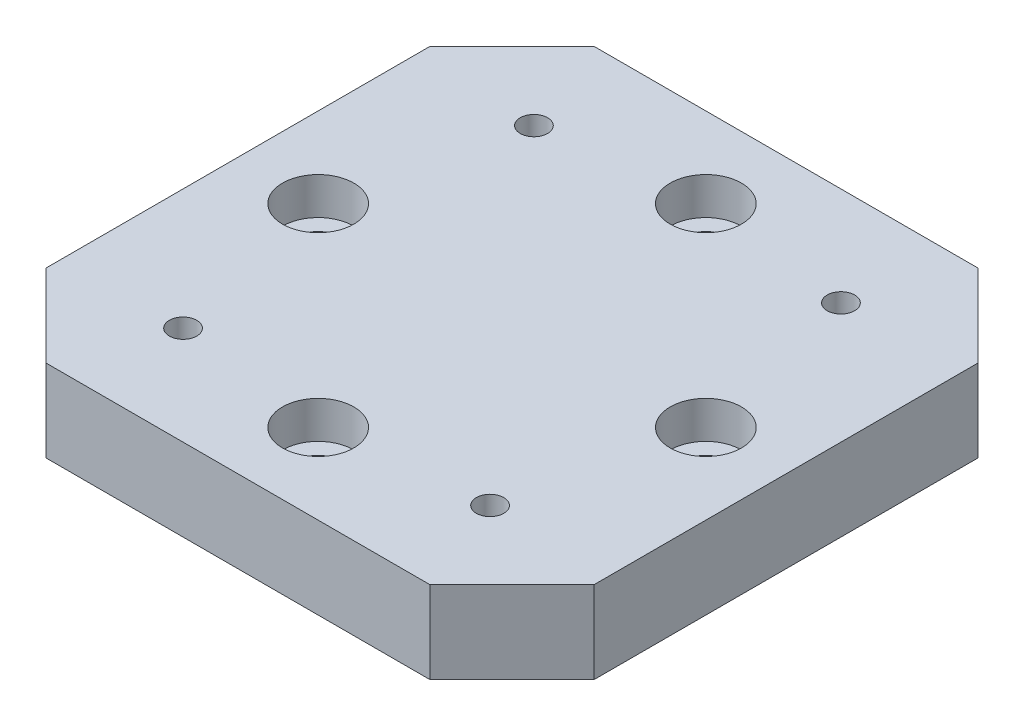
ISO-10303-21;
HEADER;
FILE_DESCRIPTION(('STEP AP214'),'2;1');
FILE_NAME('part.step','',(''),(''),'','','');
FILE_SCHEMA(('AUTOMOTIVE_DESIGN { 1 0 10303 214 1 1 1 1 }'));
ENDSEC;
DATA;
#1=APPLICATION_CONTEXT('core data for automotive mechanical design processes');
#2=APPLICATION_PROTOCOL_DEFINITION('international standard','automotive_design',2000,#1);
#3=PRODUCT_CONTEXT('',#1,'mechanical');
#4=PRODUCT('Part','Part','',(#3));
#5=PRODUCT_RELATED_PRODUCT_CATEGORY('part','',(#4));
#6=PRODUCT_DEFINITION_FORMATION('','',#4);
#7=PRODUCT_DEFINITION_CONTEXT('part definition',#1,'design');
#8=PRODUCT_DEFINITION('design','',#6,#7);
#9=PRODUCT_DEFINITION_SHAPE('','',#8);
#10=(LENGTH_UNIT() NAMED_UNIT(*) SI_UNIT(.MILLI.,.METRE.));
#11=(NAMED_UNIT(*) PLANE_ANGLE_UNIT() SI_UNIT($,.RADIAN.));
#12=(NAMED_UNIT(*) SI_UNIT($,.STERADIAN.) SOLID_ANGLE_UNIT());
#13=UNCERTAINTY_MEASURE_WITH_UNIT(LENGTH_MEASURE(1.E-05),#10,'distance_accuracy_value','');
#14=(GEOMETRIC_REPRESENTATION_CONTEXT(3) GLOBAL_UNCERTAINTY_ASSIGNED_CONTEXT((#13)) GLOBAL_UNIT_ASSIGNED_CONTEXT((#10,
#11,#12)) REPRESENTATION_CONTEXT('',''));
#15=CARTESIAN_POINT('',(0.,0.,0.));
#16=DIRECTION('',(0.,0.,1.));
#17=DIRECTION('',(1.,0.,0.));
#18=AXIS2_PLACEMENT_3D('',#15,#16,#17);
#19=CARTESIAN_POINT('',(0.,7.5,0.));
#20=DIRECTION('',(0.,-1.,0.));
#21=DIRECTION('',(0.,0.,-1.));
#22=AXIS2_PLACEMENT_3D('',#19,#20,#21);
#23=PLANE('',#22);
#24=CARTESIAN_POINT('',(0.,7.5,-17.6776695296637));
#25=DIRECTION('',(0.,1.,0.));
#26=DIRECTION('',(0.,0.,1.));
#27=AXIS2_PLACEMENT_3D('',#24,#25,#26);
#28=CIRCLE('',#27,3.25);
#29=CARTESIAN_POINT('',(0.,7.5,-14.4276695296637));
#30=VERTEX_POINT('',#29);
#31=EDGE_CURVE('E254',#30,#30,#28,.T.);
#32=ORIENTED_EDGE('',*,*,#31,.F.);
#33=EDGE_LOOP('',(#32));
#34=FACE_BOUND('',#33,.T.);
#35=CARTESIAN_POINT('',(-17.6776695296637,7.5,0.));
#36=DIRECTION('',(0.,1.,0.));
#37=DIRECTION('',(0.,0.,1.));
#38=AXIS2_PLACEMENT_3D('',#35,#36,#37);
#39=CIRCLE('',#38,3.25);
#40=CARTESIAN_POINT('',(-17.6776695296637,7.5,3.25));
#41=VERTEX_POINT('',#40);
#42=EDGE_CURVE('E242',#41,#41,#39,.T.);
#43=ORIENTED_EDGE('',*,*,#42,.F.);
#44=EDGE_LOOP('',(#43));
#45=FACE_BOUND('',#44,.T.);
#46=CARTESIAN_POINT('',(17.6776695296637,7.5,0.));
#47=DIRECTION('',(0.,1.,0.));
#48=DIRECTION('',(0.,0.,1.));
#49=AXIS2_PLACEMENT_3D('',#46,#47,#48);
#50=CIRCLE('',#49,3.25);
#51=CARTESIAN_POINT('',(17.6776695296637,7.5,3.24999999999999));
#52=VERTEX_POINT('',#51);
#53=EDGE_CURVE('E230',#52,#52,#50,.T.);
#54=ORIENTED_EDGE('',*,*,#53,.F.);
#55=EDGE_LOOP('',(#54));
#56=FACE_BOUND('',#55,.T.);
#57=CARTESIAN_POINT('',(0.,7.5,17.6776695296637));
#58=DIRECTION('',(0.,1.,0.));
#59=DIRECTION('',(0.,0.,1.));
#60=AXIS2_PLACEMENT_3D('',#57,#58,#59);
#61=CIRCLE('',#60,3.25);
#62=CARTESIAN_POINT('',(0.,7.5,20.9276695296637));
#63=VERTEX_POINT('',#62);
#64=EDGE_CURVE('E218',#63,#63,#61,.T.);
#65=ORIENTED_EDGE('',*,*,#64,.F.);
#66=EDGE_LOOP('',(#65));
#67=FACE_BOUND('',#66,.T.);
#68=CARTESIAN_POINT('',(-14.,7.5,-16.));
#69=DIRECTION('',(0.,1.,0.));
#70=DIRECTION('',(0.,0.,1.));
#71=AXIS2_PLACEMENT_3D('',#68,#69,#70);
#72=CIRCLE('',#71,1.24999999999999);
#73=CARTESIAN_POINT('',(-14.,7.5,-14.75));
#74=VERTEX_POINT('',#73);
#75=EDGE_CURVE('E200',#74,#74,#72,.T.);
#76=ORIENTED_EDGE('',*,*,#75,.F.);
#77=EDGE_LOOP('',(#76));
#78=FACE_BOUND('',#77,.T.);
#79=CARTESIAN_POINT('',(14.,7.5,16.));
#80=DIRECTION('',(0.,1.,0.));
#81=DIRECTION('',(0.,0.,1.));
#82=AXIS2_PLACEMENT_3D('',#79,#80,#81);
#83=CIRCLE('',#82,1.24999999999999);
#84=CARTESIAN_POINT('',(14.,7.5,17.25));
#85=VERTEX_POINT('',#84);
#86=EDGE_CURVE('E139',#85,#85,#83,.T.);
#87=ORIENTED_EDGE('',*,*,#86,.F.);
#88=EDGE_LOOP('',(#87));
#89=FACE_BOUND('',#88,.T.);
#90=DIRECTION('',(1.,0.,0.));
#91=VECTOR('',#90,1.);
#92=CARTESIAN_POINT('',(-25.,7.5,25.));
#93=LINE('',#92,#91);
#94=CARTESIAN_POINT('',(-17.5,7.5,25.));
#95=VERTEX_POINT('',#94);
#96=CARTESIAN_POINT('',(17.5,7.5,25.));
#97=VERTEX_POINT('',#96);
#98=EDGE_CURVE('E142',#95,#97,#93,.T.);
#99=ORIENTED_EDGE('',*,*,#98,.T.);
#100=DIRECTION('',(-0.707106781186549,0.,0.707106781186546));
#101=VECTOR('',#100,1.);
#102=CARTESIAN_POINT('',(25.,7.5,17.5));
#103=LINE('',#102,#101);
#104=CARTESIAN_POINT('',(25.,7.5,17.5));
#105=VERTEX_POINT('',#104);
#106=EDGE_CURVE('E160',#97,#105,#103,.F.);
#107=ORIENTED_EDGE('',*,*,#106,.T.);
#108=DIRECTION('',(0.,0.,-1.));
#109=VECTOR('',#108,1.);
#110=CARTESIAN_POINT('',(25.,7.5,25.));
#111=LINE('',#110,#109);
#112=CARTESIAN_POINT('',(25.,7.5,-17.5));
#113=VERTEX_POINT('',#112);
#114=EDGE_CURVE('E125',#105,#113,#111,.T.);
#115=ORIENTED_EDGE('',*,*,#114,.T.);
#116=DIRECTION('',(0.707106781186546,0.,0.70710678118655));
#117=VECTOR('',#116,1.);
#118=CARTESIAN_POINT('',(17.5,7.5,-25.));
#119=LINE('',#118,#117);
#120=CARTESIAN_POINT('',(17.5,7.5,-25.));
#121=VERTEX_POINT('',#120);
#122=EDGE_CURVE('E156',#113,#121,#119,.F.);
#123=ORIENTED_EDGE('',*,*,#122,.T.);
#124=DIRECTION('',(-1.,0.,0.));
#125=VECTOR('',#124,1.);
#126=CARTESIAN_POINT('',(-25.,7.5,-25.));
#127=LINE('',#126,#125);
#128=CARTESIAN_POINT('',(-17.5,7.5,-25.));
#129=VERTEX_POINT('',#128);
#130=EDGE_CURVE('E169',#121,#129,#127,.T.);
#131=ORIENTED_EDGE('',*,*,#130,.T.);
#132=DIRECTION('',(0.707106781186549,0.,-0.707106781186546));
#133=VECTOR('',#132,1.);
#134=CARTESIAN_POINT('',(-25.,7.5,-17.5));
#135=LINE('',#134,#133);
#136=CARTESIAN_POINT('',(-25.,7.5,-17.5));
#137=VERTEX_POINT('',#136);
#138=EDGE_CURVE('E60',#129,#137,#135,.F.);
#139=ORIENTED_EDGE('',*,*,#138,.T.);
#140=DIRECTION('',(0.,0.,1.));
#141=VECTOR('',#140,1.);
#142=CARTESIAN_POINT('',(-25.,7.5,25.));
#143=LINE('',#142,#141);
#144=CARTESIAN_POINT('',(-25.,7.5,17.5));
#145=VERTEX_POINT('',#144);
#146=EDGE_CURVE('E175',#137,#145,#143,.T.);
#147=ORIENTED_EDGE('',*,*,#146,.T.);
#148=DIRECTION('',(-0.707106781186546,0.,-0.707106781186549));
#149=VECTOR('',#148,1.);
#150=CARTESIAN_POINT('',(-17.5,7.5,25.));
#151=LINE('',#150,#149);
#152=EDGE_CURVE('E158',#145,#95,#151,.F.);
#153=ORIENTED_EDGE('',*,*,#152,.T.);
#154=EDGE_LOOP('',(#99,#107,#115,#123,#131,#139,#147,#153));
#155=FACE_BOUND('',#154,.T.);
#156=CARTESIAN_POINT('',(14.,7.5,-16.));
#157=DIRECTION('',(0.,1.,0.));
#158=DIRECTION('',(0.,0.,1.));
#159=AXIS2_PLACEMENT_3D('',#156,#157,#158);
#160=CIRCLE('',#159,1.24999999999999);
#161=CARTESIAN_POINT('',(14.,7.5,-14.75));
#162=VERTEX_POINT('',#161);
#163=EDGE_CURVE('E194',#162,#162,#160,.T.);
#164=ORIENTED_EDGE('',*,*,#163,.F.);
#165=EDGE_LOOP('',(#164));
#166=FACE_BOUND('',#165,.T.);
#167=CARTESIAN_POINT('',(-14.,7.5,16.));
#168=DIRECTION('',(0.,1.,0.));
#169=DIRECTION('',(0.,0.,1.));
#170=AXIS2_PLACEMENT_3D('',#167,#168,#169);
#171=CIRCLE('',#170,1.24999999999999);
#172=CARTESIAN_POINT('',(-14.,7.5,17.25));
#173=VERTEX_POINT('',#172);
#174=EDGE_CURVE('E206',#173,#173,#171,.T.);
#175=ORIENTED_EDGE('',*,*,#174,.F.);
#176=EDGE_LOOP('',(#175));
#177=FACE_BOUND('',#176,.T.);
#178=ADVANCED_FACE('F38',(#34,#45,#56,#67,#78,#89,#155,#166,#177),#23,.F.);
#179=CARTESIAN_POINT('',(25.,7.5,25.));
#180=DIRECTION('',(-1.,0.,0.));
#181=DIRECTION('',(0.,0.,1.));
#182=AXIS2_PLACEMENT_3D('',#179,#180,#181);
#183=PLANE('',#182);
#184=ORIENTED_EDGE('',*,*,#114,.F.);
#185=DIRECTION('',(0.,-1.,0.));
#186=VECTOR('',#185,1.);
#187=CARTESIAN_POINT('',(25.,7.5,17.5));
#188=LINE('',#187,#186);
#189=CARTESIAN_POINT('',(25.,0.,17.5));
#190=VERTEX_POINT('',#189);
#191=EDGE_CURVE('E109',#105,#190,#188,.T.);
#192=ORIENTED_EDGE('',*,*,#191,.T.);
#193=DIRECTION('',(0.,0.,-1.));
#194=VECTOR('',#193,1.);
#195=CARTESIAN_POINT('',(25.,0.,25.));
#196=LINE('',#195,#194);
#197=CARTESIAN_POINT('',(25.,0.,-17.5));
#198=VERTEX_POINT('',#197);
#199=EDGE_CURVE('E122',#190,#198,#196,.T.);
#200=ORIENTED_EDGE('',*,*,#199,.T.);
#201=DIRECTION('',(0.,1.,0.));
#202=VECTOR('',#201,1.);
#203=CARTESIAN_POINT('',(25.,7.5,-17.5));
#204=LINE('',#203,#202);
#205=EDGE_CURVE('E127',#198,#113,#204,.T.);
#206=ORIENTED_EDGE('',*,*,#205,.T.);
#207=EDGE_LOOP('',(#184,#192,#200,#206));
#208=FACE_BOUND('',#207,.T.);
#209=ADVANCED_FACE('F121',(#208),#183,.F.);
#210=CARTESIAN_POINT('',(-25.,7.5,-25.));
#211=DIRECTION('',(0.,0.,1.));
#212=DIRECTION('',(1.,0.,0.));
#213=AXIS2_PLACEMENT_3D('',#210,#211,#212);
#214=PLANE('',#213);
#215=ORIENTED_EDGE('',*,*,#130,.F.);
#216=DIRECTION('',(0.,-1.,0.));
#217=VECTOR('',#216,1.);
#218=CARTESIAN_POINT('',(17.5,7.5,-25.));
#219=LINE('',#218,#217);
#220=CARTESIAN_POINT('',(17.5,0.,-25.));
#221=VERTEX_POINT('',#220);
#222=EDGE_CURVE('E11',#121,#221,#219,.T.);
#223=ORIENTED_EDGE('',*,*,#222,.T.);
#224=DIRECTION('',(-1.,0.,0.));
#225=VECTOR('',#224,1.);
#226=CARTESIAN_POINT('',(-25.,0.,-25.));
#227=LINE('',#226,#225);
#228=CARTESIAN_POINT('',(-17.5,0.,-25.));
#229=VERTEX_POINT('',#228);
#230=EDGE_CURVE('E132',#221,#229,#227,.T.);
#231=ORIENTED_EDGE('',*,*,#230,.T.);
#232=DIRECTION('',(0.,1.,0.));
#233=VECTOR('',#232,1.);
#234=CARTESIAN_POINT('',(-17.5,7.5,-25.));
#235=LINE('',#234,#233);
#236=EDGE_CURVE('E46',#229,#129,#235,.T.);
#237=ORIENTED_EDGE('',*,*,#236,.T.);
#238=EDGE_LOOP('',(#215,#223,#231,#237));
#239=FACE_BOUND('',#238,.T.);
#240=ADVANCED_FACE('F168',(#239),#214,.F.);
#241=CARTESIAN_POINT('',(-25.,7.5,25.));
#242=DIRECTION('',(1.,0.,0.));
#243=DIRECTION('',(0.,0.,-1.));
#244=AXIS2_PLACEMENT_3D('',#241,#242,#243);
#245=PLANE('',#244);
#246=DIRECTION('',(0.,0.,1.));
#247=VECTOR('',#246,1.);
#248=CARTESIAN_POINT('',(-25.,0.,25.));
#249=LINE('',#248,#247);
#250=CARTESIAN_POINT('',(-25.,0.,-17.5));
#251=VERTEX_POINT('',#250);
#252=CARTESIAN_POINT('',(-25.,0.,17.5));
#253=VERTEX_POINT('',#252);
#254=EDGE_CURVE('E136',#251,#253,#249,.T.);
#255=ORIENTED_EDGE('',*,*,#254,.T.);
#256=DIRECTION('',(0.,1.,0.));
#257=VECTOR('',#256,1.);
#258=CARTESIAN_POINT('',(-25.,7.5,17.5));
#259=LINE('',#258,#257);
#260=EDGE_CURVE('E53',#253,#145,#259,.T.);
#261=ORIENTED_EDGE('',*,*,#260,.T.);
#262=ORIENTED_EDGE('',*,*,#146,.F.);
#263=DIRECTION('',(0.,-1.,0.));
#264=VECTOR('',#263,1.);
#265=CARTESIAN_POINT('',(-25.,7.5,-17.5));
#266=LINE('',#265,#264);
#267=EDGE_CURVE('E162',#137,#251,#266,.T.);
#268=ORIENTED_EDGE('',*,*,#267,.T.);
#269=EDGE_LOOP('',(#255,#261,#262,#268));
#270=FACE_BOUND('',#269,.T.);
#271=ADVANCED_FACE('F179',(#270),#245,.F.);
#272=CARTESIAN_POINT('',(-25.,7.5,25.));
#273=DIRECTION('',(0.,0.,-1.));
#274=DIRECTION('',(-1.,0.,0.));
#275=AXIS2_PLACEMENT_3D('',#272,#273,#274);
#276=PLANE('',#275);
#277=DIRECTION('',(1.,0.,0.));
#278=VECTOR('',#277,1.);
#279=CARTESIAN_POINT('',(-25.,0.,25.));
#280=LINE('',#279,#278);
#281=CARTESIAN_POINT('',(-17.5,0.,25.));
#282=VERTEX_POINT('',#281);
#283=CARTESIAN_POINT('',(17.5,0.,25.));
#284=VERTEX_POINT('',#283);
#285=EDGE_CURVE('E146',#282,#284,#280,.T.);
#286=ORIENTED_EDGE('',*,*,#285,.T.);
#287=DIRECTION('',(0.,1.,0.));
#288=VECTOR('',#287,1.);
#289=CARTESIAN_POINT('',(17.5,7.5,25.));
#290=LINE('',#289,#288);
#291=EDGE_CURVE('E110',#284,#97,#290,.T.);
#292=ORIENTED_EDGE('',*,*,#291,.T.);
#293=ORIENTED_EDGE('',*,*,#98,.F.);
#294=DIRECTION('',(0.,-1.,0.));
#295=VECTOR('',#294,1.);
#296=CARTESIAN_POINT('',(-17.5,7.5,25.));
#297=LINE('',#296,#295);
#298=EDGE_CURVE('E115',#95,#282,#297,.T.);
#299=ORIENTED_EDGE('',*,*,#298,.T.);
#300=EDGE_LOOP('',(#286,#292,#293,#299));
#301=FACE_BOUND('',#300,.T.);
#302=ADVANCED_FACE('F186',(#301),#276,.F.);
#303=CARTESIAN_POINT('',(0.,0.,0.));
#304=DIRECTION('',(0.,-1.,0.));
#305=DIRECTION('',(0.,0.,-1.));
#306=AXIS2_PLACEMENT_3D('',#303,#304,#305);
#307=PLANE('',#306);
#308=CARTESIAN_POINT('',(0.,0.,-17.6776695296637));
#309=DIRECTION('',(0.,-1.,0.));
#310=DIRECTION('',(0.,0.,-1.));
#311=AXIS2_PLACEMENT_3D('',#308,#309,#310);
#312=CIRCLE('',#311,1.7);
#313=CARTESIAN_POINT('',(0.,0.,-19.3776695296637));
#314=VERTEX_POINT('',#313);
#315=EDGE_CURVE('E245',#314,#314,#312,.T.);
#316=ORIENTED_EDGE('',*,*,#315,.F.);
#317=EDGE_LOOP('',(#316));
#318=FACE_BOUND('',#317,.T.);
#319=CARTESIAN_POINT('',(-17.6776695296637,0.,0.));
#320=DIRECTION('',(0.,-1.,0.));
#321=DIRECTION('',(0.,0.,-1.));
#322=AXIS2_PLACEMENT_3D('',#319,#320,#321);
#323=CIRCLE('',#322,1.7);
#324=CARTESIAN_POINT('',(-17.6776695296637,0.,-1.7));
#325=VERTEX_POINT('',#324);
#326=EDGE_CURVE('E233',#325,#325,#323,.T.);
#327=ORIENTED_EDGE('',*,*,#326,.F.);
#328=EDGE_LOOP('',(#327));
#329=FACE_BOUND('',#328,.T.);
#330=CARTESIAN_POINT('',(17.6776695296637,0.,0.));
#331=DIRECTION('',(0.,-1.,0.));
#332=DIRECTION('',(0.,0.,-1.));
#333=AXIS2_PLACEMENT_3D('',#330,#331,#332);
#334=CIRCLE('',#333,1.7);
#335=CARTESIAN_POINT('',(17.6776695296637,0.,-1.7));
#336=VERTEX_POINT('',#335);
#337=EDGE_CURVE('E221',#336,#336,#334,.T.);
#338=ORIENTED_EDGE('',*,*,#337,.F.);
#339=EDGE_LOOP('',(#338));
#340=FACE_BOUND('',#339,.T.);
#341=CARTESIAN_POINT('',(0.,0.,17.6776695296637));
#342=DIRECTION('',(0.,-1.,0.));
#343=DIRECTION('',(0.,0.,-1.));
#344=AXIS2_PLACEMENT_3D('',#341,#342,#343);
#345=CIRCLE('',#344,1.7);
#346=CARTESIAN_POINT('',(0.,0.,15.9776695296637));
#347=VERTEX_POINT('',#346);
#348=EDGE_CURVE('E209',#347,#347,#345,.T.);
#349=ORIENTED_EDGE('',*,*,#348,.F.);
#350=EDGE_LOOP('',(#349));
#351=FACE_BOUND('',#350,.T.);
#352=CARTESIAN_POINT('',(-14.,0.,16.));
#353=DIRECTION('',(0.,-1.,0.));
#354=DIRECTION('',(0.,0.,-1.));
#355=AXIS2_PLACEMENT_3D('',#352,#353,#354);
#356=CIRCLE('',#355,1.24999999999999);
#357=CARTESIAN_POINT('',(-14.,0.,14.75));
#358=VERTEX_POINT('',#357);
#359=EDGE_CURVE('E203',#358,#358,#356,.T.);
#360=ORIENTED_EDGE('',*,*,#359,.F.);
#361=EDGE_LOOP('',(#360));
#362=FACE_BOUND('',#361,.T.);
#363=CARTESIAN_POINT('',(-14.,0.,-16.));
#364=DIRECTION('',(0.,-1.,0.));
#365=DIRECTION('',(0.,0.,-1.));
#366=AXIS2_PLACEMENT_3D('',#363,#364,#365);
#367=CIRCLE('',#366,1.24999999999999);
#368=CARTESIAN_POINT('',(-14.,0.,-17.25));
#369=VERTEX_POINT('',#368);
#370=EDGE_CURVE('E197',#369,#369,#367,.T.);
#371=ORIENTED_EDGE('',*,*,#370,.F.);
#372=EDGE_LOOP('',(#371));
#373=FACE_BOUND('',#372,.T.);
#374=CARTESIAN_POINT('',(14.,0.,-16.));
#375=DIRECTION('',(0.,-1.,0.));
#376=DIRECTION('',(0.,0.,-1.));
#377=AXIS2_PLACEMENT_3D('',#374,#375,#376);
#378=CIRCLE('',#377,1.24999999999999);
#379=CARTESIAN_POINT('',(14.,0.,-17.25));
#380=VERTEX_POINT('',#379);
#381=EDGE_CURVE('E191',#380,#380,#378,.T.);
#382=ORIENTED_EDGE('',*,*,#381,.F.);
#383=EDGE_LOOP('',(#382));
#384=FACE_BOUND('',#383,.T.);
#385=CARTESIAN_POINT('',(14.,0.,16.));
#386=DIRECTION('',(0.,-1.,0.));
#387=DIRECTION('',(0.,0.,-1.));
#388=AXIS2_PLACEMENT_3D('',#385,#386,#387);
#389=CIRCLE('',#388,1.24999999999999);
#390=CARTESIAN_POINT('',(14.,0.,14.75));
#391=VERTEX_POINT('',#390);
#392=EDGE_CURVE('E133',#391,#391,#389,.T.);
#393=ORIENTED_EDGE('',*,*,#392,.F.);
#394=EDGE_LOOP('',(#393));
#395=FACE_BOUND('',#394,.T.);
#396=ORIENTED_EDGE('',*,*,#199,.F.);
#397=DIRECTION('',(0.707106781186549,0.,-0.707106781186546));
#398=VECTOR('',#397,1.);
#399=CARTESIAN_POINT('',(21.2499999999999,0.,21.25));
#400=LINE('',#399,#398);
#401=EDGE_CURVE('E105',#190,#284,#400,.F.);
#402=ORIENTED_EDGE('',*,*,#401,.T.);
#403=ORIENTED_EDGE('',*,*,#285,.F.);
#404=DIRECTION('',(0.707106781186546,0.,0.707106781186549));
#405=VECTOR('',#404,1.);
#406=CARTESIAN_POINT('',(-21.25,0.,21.2499999999999));
#407=LINE('',#406,#405);
#408=EDGE_CURVE('E116',#282,#253,#407,.F.);
#409=ORIENTED_EDGE('',*,*,#408,.T.);
#410=ORIENTED_EDGE('',*,*,#254,.F.);
#411=DIRECTION('',(-0.707106781186549,0.,0.707106781186546));
#412=VECTOR('',#411,1.);
#413=CARTESIAN_POINT('',(-21.2499999999999,0.,-21.25));
#414=LINE('',#413,#412);
#415=EDGE_CURVE('E126',#251,#229,#414,.F.);
#416=ORIENTED_EDGE('',*,*,#415,.T.);
#417=ORIENTED_EDGE('',*,*,#230,.F.);
#418=DIRECTION('',(-0.707106781186546,0.,-0.70710678118655));
#419=VECTOR('',#418,1.);
#420=CARTESIAN_POINT('',(21.2500000000001,0.,-21.2499999999999));
#421=LINE('',#420,#419);
#422=EDGE_CURVE('E131',#221,#198,#421,.F.);
#423=ORIENTED_EDGE('',*,*,#422,.T.);
#424=EDGE_LOOP('',(#396,#402,#403,#409,#410,#416,#417,#423));
#425=FACE_BOUND('',#424,.T.);
#426=ADVANCED_FACE('F129',(#318,#329,#340,#351,#362,#373,#384,#395,#425),#307,.T.);
#427=CARTESIAN_POINT('',(14.,7.5,16.));
#428=DIRECTION('',(0.,1.,0.));
#429=DIRECTION('',(0.,0.,1.));
#430=AXIS2_PLACEMENT_3D('',#427,#428,#429);
#431=CYLINDRICAL_SURFACE('',#430,1.24999999999999);
#432=ORIENTED_EDGE('',*,*,#86,.T.);
#433=EDGE_LOOP('',(#432));
#434=FACE_BOUND('',#433,.T.);
#435=ORIENTED_EDGE('',*,*,#392,.T.);
#436=EDGE_LOOP('',(#435));
#437=FACE_BOUND('',#436,.T.);
#438=ADVANCED_FACE('F273',(#434,#437),#431,.F.);
#439=CARTESIAN_POINT('',(14.,7.5,-16.));
#440=DIRECTION('',(0.,1.,0.));
#441=DIRECTION('',(0.,0.,1.));
#442=AXIS2_PLACEMENT_3D('',#439,#440,#441);
#443=CYLINDRICAL_SURFACE('',#442,1.24999999999999);
#444=ORIENTED_EDGE('',*,*,#163,.T.);
#445=EDGE_LOOP('',(#444));
#446=FACE_BOUND('',#445,.T.);
#447=ORIENTED_EDGE('',*,*,#381,.T.);
#448=EDGE_LOOP('',(#447));
#449=FACE_BOUND('',#448,.T.);
#450=ADVANCED_FACE('F276',(#446,#449),#443,.F.);
#451=CARTESIAN_POINT('',(-14.,7.5,-16.));
#452=DIRECTION('',(0.,1.,0.));
#453=DIRECTION('',(0.,0.,1.));
#454=AXIS2_PLACEMENT_3D('',#451,#452,#453);
#455=CYLINDRICAL_SURFACE('',#454,1.24999999999999);
#456=ORIENTED_EDGE('',*,*,#75,.T.);
#457=EDGE_LOOP('',(#456));
#458=FACE_BOUND('',#457,.T.);
#459=ORIENTED_EDGE('',*,*,#370,.T.);
#460=EDGE_LOOP('',(#459));
#461=FACE_BOUND('',#460,.T.);
#462=ADVANCED_FACE('F488',(#458,#461),#455,.F.);
#463=CARTESIAN_POINT('',(-14.,7.5,16.));
#464=DIRECTION('',(0.,1.,0.));
#465=DIRECTION('',(0.,0.,1.));
#466=AXIS2_PLACEMENT_3D('',#463,#464,#465);
#467=CYLINDRICAL_SURFACE('',#466,1.24999999999999);
#468=ORIENTED_EDGE('',*,*,#174,.T.);
#469=EDGE_LOOP('',(#468));
#470=FACE_BOUND('',#469,.T.);
#471=ORIENTED_EDGE('',*,*,#359,.T.);
#472=EDGE_LOOP('',(#471));
#473=FACE_BOUND('',#472,.T.);
#474=ADVANCED_FACE('F477',(#470,#473),#467,.F.);
#475=CARTESIAN_POINT('',(0.,7.5,17.6776695296637));
#476=DIRECTION('',(0.,1.,0.));
#477=DIRECTION('',(0.,0.,1.));
#478=AXIS2_PLACEMENT_3D('',#475,#476,#477);
#479=CYLINDRICAL_SURFACE('',#478,1.7);
#480=CARTESIAN_POINT('',(0.,4.1,17.6776695296637));
#481=DIRECTION('',(0.,1.,0.));
#482=DIRECTION('',(0.,0.,1.));
#483=AXIS2_PLACEMENT_3D('',#480,#481,#482);
#484=CIRCLE('',#483,1.7);
#485=CARTESIAN_POINT('',(0.,4.1,19.3776695296637));
#486=VERTEX_POINT('',#485);
#487=EDGE_CURVE('E212',#486,#486,#484,.T.);
#488=ORIENTED_EDGE('',*,*,#487,.T.);
#489=EDGE_LOOP('',(#488));
#490=FACE_BOUND('',#489,.T.);
#491=ORIENTED_EDGE('',*,*,#348,.T.);
#492=EDGE_LOOP('',(#491));
#493=FACE_BOUND('',#492,.T.);
#494=ADVANCED_FACE('F467',(#490,#493),#479,.F.);
#495=CARTESIAN_POINT('',(1.7,4.1,17.6776695296637));
#496=DIRECTION('',(0.,-1.,0.));
#497=DIRECTION('',(0.,0.,-1.));
#498=AXIS2_PLACEMENT_3D('',#495,#496,#497);
#499=PLANE('',#498);
#500=ORIENTED_EDGE('',*,*,#487,.F.);
#501=EDGE_LOOP('',(#500));
#502=FACE_BOUND('',#501,.T.);
#503=CARTESIAN_POINT('',(0.,4.1,17.6776695296637));
#504=DIRECTION('',(0.,1.,0.));
#505=DIRECTION('',(0.,0.,1.));
#506=AXIS2_PLACEMENT_3D('',#503,#504,#505);
#507=CIRCLE('',#506,3.25);
#508=CARTESIAN_POINT('',(0.,4.1,20.9276695296637));
#509=VERTEX_POINT('',#508);
#510=EDGE_CURVE('E215',#509,#509,#507,.T.);
#511=ORIENTED_EDGE('',*,*,#510,.T.);
#512=EDGE_LOOP('',(#511));
#513=FACE_BOUND('',#512,.T.);
#514=ADVANCED_FACE('F457',(#502,#513),#499,.F.);
#515=CARTESIAN_POINT('',(0.,7.5,17.6776695296637));
#516=DIRECTION('',(0.,1.,0.));
#517=DIRECTION('',(0.,0.,1.));
#518=AXIS2_PLACEMENT_3D('',#515,#516,#517);
#519=CYLINDRICAL_SURFACE('',#518,3.25);
#520=ORIENTED_EDGE('',*,*,#510,.F.);
#521=EDGE_LOOP('',(#520));
#522=FACE_BOUND('',#521,.T.);
#523=ORIENTED_EDGE('',*,*,#64,.T.);
#524=EDGE_LOOP('',(#523));
#525=FACE_BOUND('',#524,.T.);
#526=ADVANCED_FACE('F447',(#522,#525),#519,.F.);
#527=CARTESIAN_POINT('',(17.6776695296637,7.5,0.));
#528=DIRECTION('',(0.,1.,0.));
#529=DIRECTION('',(0.,0.,1.));
#530=AXIS2_PLACEMENT_3D('',#527,#528,#529);
#531=CYLINDRICAL_SURFACE('',#530,1.7);
#532=CARTESIAN_POINT('',(17.6776695296637,4.1,0.));
#533=DIRECTION('',(0.,1.,0.));
#534=DIRECTION('',(0.,0.,1.));
#535=AXIS2_PLACEMENT_3D('',#532,#533,#534);
#536=CIRCLE('',#535,1.7);
#537=CARTESIAN_POINT('',(17.6776695296637,4.1,1.69999999999999));
#538=VERTEX_POINT('',#537);
#539=EDGE_CURVE('E224',#538,#538,#536,.T.);
#540=ORIENTED_EDGE('',*,*,#539,.T.);
#541=EDGE_LOOP('',(#540));
#542=FACE_BOUND('',#541,.T.);
#543=ORIENTED_EDGE('',*,*,#337,.T.);
#544=EDGE_LOOP('',(#543));
#545=FACE_BOUND('',#544,.T.);
#546=ADVANCED_FACE('F437',(#542,#545),#531,.F.);
#547=CARTESIAN_POINT('',(19.3776695296637,4.1,0.));
#548=DIRECTION('',(0.,-1.,0.));
#549=DIRECTION('',(0.,0.,-1.));
#550=AXIS2_PLACEMENT_3D('',#547,#548,#549);
#551=PLANE('',#550);
#552=ORIENTED_EDGE('',*,*,#539,.F.);
#553=EDGE_LOOP('',(#552));
#554=FACE_BOUND('',#553,.T.);
#555=CARTESIAN_POINT('',(17.6776695296637,4.1,0.));
#556=DIRECTION('',(0.,1.,0.));
#557=DIRECTION('',(0.,0.,1.));
#558=AXIS2_PLACEMENT_3D('',#555,#556,#557);
#559=CIRCLE('',#558,3.25);
#560=CARTESIAN_POINT('',(17.6776695296637,4.1,3.24999999999999));
#561=VERTEX_POINT('',#560);
#562=EDGE_CURVE('E227',#561,#561,#559,.T.);
#563=ORIENTED_EDGE('',*,*,#562,.T.);
#564=EDGE_LOOP('',(#563));
#565=FACE_BOUND('',#564,.T.);
#566=ADVANCED_FACE('F427',(#554,#565),#551,.F.);
#567=CARTESIAN_POINT('',(17.6776695296637,7.5,0.));
#568=DIRECTION('',(0.,1.,0.));
#569=DIRECTION('',(0.,0.,1.));
#570=AXIS2_PLACEMENT_3D('',#567,#568,#569);
#571=CYLINDRICAL_SURFACE('',#570,3.25);
#572=ORIENTED_EDGE('',*,*,#562,.F.);
#573=EDGE_LOOP('',(#572));
#574=FACE_BOUND('',#573,.T.);
#575=ORIENTED_EDGE('',*,*,#53,.T.);
#576=EDGE_LOOP('',(#575));
#577=FACE_BOUND('',#576,.T.);
#578=ADVANCED_FACE('F417',(#574,#577),#571,.F.);
#579=CARTESIAN_POINT('',(-17.6776695296637,7.5,0.));
#580=DIRECTION('',(0.,1.,0.));
#581=DIRECTION('',(0.,0.,1.));
#582=AXIS2_PLACEMENT_3D('',#579,#580,#581);
#583=CYLINDRICAL_SURFACE('',#582,1.7);
#584=CARTESIAN_POINT('',(-17.6776695296637,4.1,0.));
#585=DIRECTION('',(0.,1.,0.));
#586=DIRECTION('',(0.,0.,1.));
#587=AXIS2_PLACEMENT_3D('',#584,#585,#586);
#588=CIRCLE('',#587,1.7);
#589=CARTESIAN_POINT('',(-17.6776695296637,4.1,1.7));
#590=VERTEX_POINT('',#589);
#591=EDGE_CURVE('E236',#590,#590,#588,.T.);
#592=ORIENTED_EDGE('',*,*,#591,.T.);
#593=EDGE_LOOP('',(#592));
#594=FACE_BOUND('',#593,.T.);
#595=ORIENTED_EDGE('',*,*,#326,.T.);
#596=EDGE_LOOP('',(#595));
#597=FACE_BOUND('',#596,.T.);
#598=ADVANCED_FACE('F407',(#594,#597),#583,.F.);
#599=CARTESIAN_POINT('',(-15.9776695296637,4.1,0.));
#600=DIRECTION('',(0.,-1.,0.));
#601=DIRECTION('',(0.,0.,-1.));
#602=AXIS2_PLACEMENT_3D('',#599,#600,#601);
#603=PLANE('',#602);
#604=ORIENTED_EDGE('',*,*,#591,.F.);
#605=EDGE_LOOP('',(#604));
#606=FACE_BOUND('',#605,.T.);
#607=CARTESIAN_POINT('',(-17.6776695296637,4.1,0.));
#608=DIRECTION('',(0.,1.,0.));
#609=DIRECTION('',(0.,0.,1.));
#610=AXIS2_PLACEMENT_3D('',#607,#608,#609);
#611=CIRCLE('',#610,3.25);
#612=CARTESIAN_POINT('',(-17.6776695296637,4.1,3.25));
#613=VERTEX_POINT('',#612);
#614=EDGE_CURVE('E239',#613,#613,#611,.T.);
#615=ORIENTED_EDGE('',*,*,#614,.T.);
#616=EDGE_LOOP('',(#615));
#617=FACE_BOUND('',#616,.T.);
#618=ADVANCED_FACE('F397',(#606,#617),#603,.F.);
#619=CARTESIAN_POINT('',(-17.6776695296637,7.5,0.));
#620=DIRECTION('',(0.,1.,0.));
#621=DIRECTION('',(0.,0.,1.));
#622=AXIS2_PLACEMENT_3D('',#619,#620,#621);
#623=CYLINDRICAL_SURFACE('',#622,3.25);
#624=ORIENTED_EDGE('',*,*,#614,.F.);
#625=EDGE_LOOP('',(#624));
#626=FACE_BOUND('',#625,.T.);
#627=ORIENTED_EDGE('',*,*,#42,.T.);
#628=EDGE_LOOP('',(#627));
#629=FACE_BOUND('',#628,.T.);
#630=ADVANCED_FACE('F387',(#626,#629),#623,.F.);
#631=CARTESIAN_POINT('',(0.,7.5,-17.6776695296637));
#632=DIRECTION('',(0.,1.,0.));
#633=DIRECTION('',(0.,0.,1.));
#634=AXIS2_PLACEMENT_3D('',#631,#632,#633);
#635=CYLINDRICAL_SURFACE('',#634,1.7);
#636=CARTESIAN_POINT('',(0.,4.1,-17.6776695296637));
#637=DIRECTION('',(0.,1.,0.));
#638=DIRECTION('',(0.,0.,1.));
#639=AXIS2_PLACEMENT_3D('',#636,#637,#638);
#640=CIRCLE('',#639,1.7);
#641=CARTESIAN_POINT('',(0.,4.1,-15.9776695296637));
#642=VERTEX_POINT('',#641);
#643=EDGE_CURVE('E248',#642,#642,#640,.T.);
#644=ORIENTED_EDGE('',*,*,#643,.T.);
#645=EDGE_LOOP('',(#644));
#646=FACE_BOUND('',#645,.T.);
#647=ORIENTED_EDGE('',*,*,#315,.T.);
#648=EDGE_LOOP('',(#647));
#649=FACE_BOUND('',#648,.T.);
#650=ADVANCED_FACE('F377',(#646,#649),#635,.F.);
#651=CARTESIAN_POINT('',(1.7,4.1,-17.6776695296637));
#652=DIRECTION('',(0.,-1.,0.));
#653=DIRECTION('',(0.,0.,-1.));
#654=AXIS2_PLACEMENT_3D('',#651,#652,#653);
#655=PLANE('',#654);
#656=ORIENTED_EDGE('',*,*,#643,.F.);
#657=EDGE_LOOP('',(#656));
#658=FACE_BOUND('',#657,.T.);
#659=CARTESIAN_POINT('',(0.,4.1,-17.6776695296637));
#660=DIRECTION('',(0.,1.,0.));
#661=DIRECTION('',(0.,0.,1.));
#662=AXIS2_PLACEMENT_3D('',#659,#660,#661);
#663=CIRCLE('',#662,3.25);
#664=CARTESIAN_POINT('',(0.,4.1,-14.4276695296637));
#665=VERTEX_POINT('',#664);
#666=EDGE_CURVE('E251',#665,#665,#663,.T.);
#667=ORIENTED_EDGE('',*,*,#666,.T.);
#668=EDGE_LOOP('',(#667));
#669=FACE_BOUND('',#668,.T.);
#670=ADVANCED_FACE('F367',(#658,#669),#655,.F.);
#671=CARTESIAN_POINT('',(0.,7.5,-17.6776695296637));
#672=DIRECTION('',(0.,1.,0.));
#673=DIRECTION('',(0.,0.,1.));
#674=AXIS2_PLACEMENT_3D('',#671,#672,#673);
#675=CYLINDRICAL_SURFACE('',#674,3.25);
#676=ORIENTED_EDGE('',*,*,#666,.F.);
#677=EDGE_LOOP('',(#676));
#678=FACE_BOUND('',#677,.T.);
#679=ORIENTED_EDGE('',*,*,#31,.T.);
#680=EDGE_LOOP('',(#679));
#681=FACE_BOUND('',#680,.T.);
#682=ADVANCED_FACE('F258',(#678,#681),#675,.F.);
#683=CARTESIAN_POINT('',(25.,7.5,17.5));
#684=DIRECTION('',(-0.707106781186546,0.,-0.707106781186549));
#685=DIRECTION('',(0.,-1.,0.));
#686=AXIS2_PLACEMENT_3D('',#683,#684,#685);
#687=PLANE('',#686);
#688=ORIENTED_EDGE('',*,*,#106,.F.);
#689=ORIENTED_EDGE('',*,*,#291,.F.);
#690=ORIENTED_EDGE('',*,*,#401,.F.);
#691=ORIENTED_EDGE('',*,*,#191,.F.);
#692=EDGE_LOOP('',(#688,#689,#690,#691));
#693=FACE_BOUND('',#692,.T.);
#694=ADVANCED_FACE('F108',(#693),#687,.F.);
#695=CARTESIAN_POINT('',(-17.5,7.5,25.));
#696=DIRECTION('',(0.707106781186549,0.,-0.707106781186546));
#697=DIRECTION('',(0.,-1.,0.));
#698=AXIS2_PLACEMENT_3D('',#695,#696,#697);
#699=PLANE('',#698);
#700=ORIENTED_EDGE('',*,*,#152,.F.);
#701=ORIENTED_EDGE('',*,*,#260,.F.);
#702=ORIENTED_EDGE('',*,*,#408,.F.);
#703=ORIENTED_EDGE('',*,*,#298,.F.);
#704=EDGE_LOOP('',(#700,#701,#702,#703));
#705=FACE_BOUND('',#704,.T.);
#706=ADVANCED_FACE('F183',(#705),#699,.F.);
#707=CARTESIAN_POINT('',(17.5,7.5,-25.));
#708=DIRECTION('',(-0.70710678118655,0.,0.707106781186546));
#709=DIRECTION('',(0.,-1.,0.));
#710=AXIS2_PLACEMENT_3D('',#707,#708,#709);
#711=PLANE('',#710);
#712=ORIENTED_EDGE('',*,*,#122,.F.);
#713=ORIENTED_EDGE('',*,*,#205,.F.);
#714=ORIENTED_EDGE('',*,*,#422,.F.);
#715=ORIENTED_EDGE('',*,*,#222,.F.);
#716=EDGE_LOOP('',(#712,#713,#714,#715));
#717=FACE_BOUND('',#716,.T.);
#718=ADVANCED_FACE('F299',(#717),#711,.F.);
#719=CARTESIAN_POINT('',(-25.,7.5,-17.5));
#720=DIRECTION('',(0.707106781186546,0.,0.707106781186549));
#721=DIRECTION('',(0.,-1.,0.));
#722=AXIS2_PLACEMENT_3D('',#719,#720,#721);
#723=PLANE('',#722);
#724=ORIENTED_EDGE('',*,*,#138,.F.);
#725=ORIENTED_EDGE('',*,*,#236,.F.);
#726=ORIENTED_EDGE('',*,*,#415,.F.);
#727=ORIENTED_EDGE('',*,*,#267,.F.);
#728=EDGE_LOOP('',(#724,#725,#726,#727));
#729=FACE_BOUND('',#728,.T.);
#730=ADVANCED_FACE('F40',(#729),#723,.F.);
#731=CLOSED_SHELL('',(#178,#209,#240,#271,#302,#426,#438,#450,#462,#474,#494,#514,#526,#546,
#566,#578,#598,#618,#630,#650,#670,#682,#694,#706,#718,#730));
#732=MANIFOLD_SOLID_BREP('B2',#731);
#733=ADVANCED_BREP_SHAPE_REPRESENTATION('',(#18,#732),#14);
#734=SHAPE_DEFINITION_REPRESENTATION(#9,#733);
ENDSEC;
END-ISO-10303-21;
